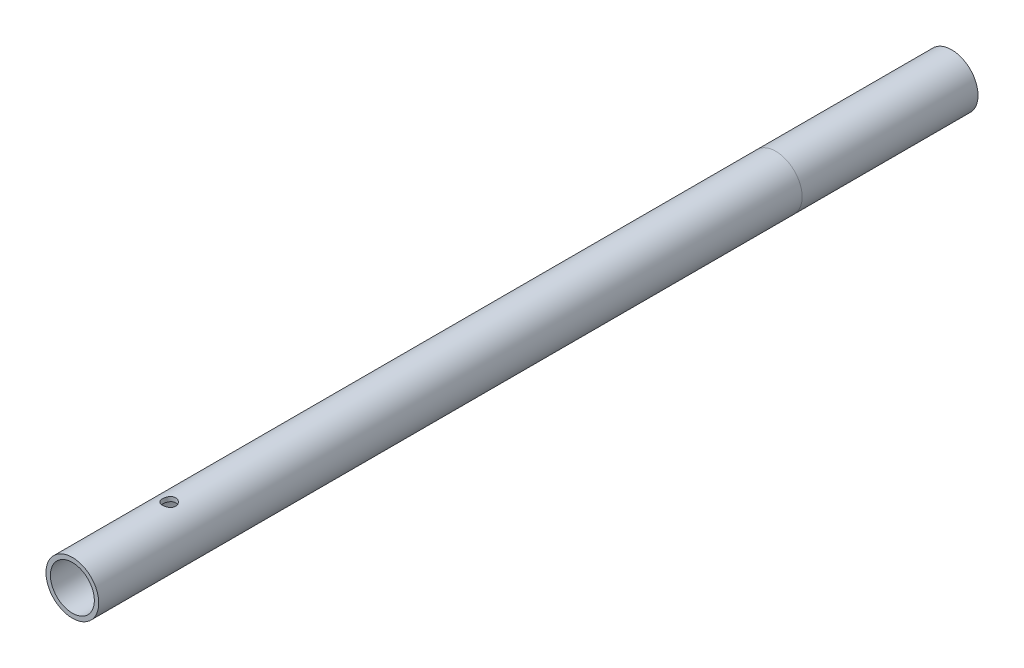
ISO-10303-21;
HEADER;
FILE_DESCRIPTION(('STEP AP214'),'2;1');
FILE_NAME('part.step','',(''),(''),'','','');
FILE_SCHEMA(('AUTOMOTIVE_DESIGN { 1 0 10303 214 1 1 1 1 }'));
ENDSEC;
DATA;
#1=APPLICATION_CONTEXT('core data for automotive mechanical design processes');
#2=APPLICATION_PROTOCOL_DEFINITION('international standard','automotive_design',2000,#1);
#3=PRODUCT_CONTEXT('',#1,'mechanical');
#4=PRODUCT('Part','Part','',(#3));
#5=PRODUCT_RELATED_PRODUCT_CATEGORY('part','',(#4));
#6=PRODUCT_DEFINITION_FORMATION('','',#4);
#7=PRODUCT_DEFINITION_CONTEXT('part definition',#1,'design');
#8=PRODUCT_DEFINITION('design','',#6,#7);
#9=PRODUCT_DEFINITION_SHAPE('','',#8);
#10=(LENGTH_UNIT() NAMED_UNIT(*) SI_UNIT(.MILLI.,.METRE.));
#11=(NAMED_UNIT(*) PLANE_ANGLE_UNIT() SI_UNIT($,.RADIAN.));
#12=(NAMED_UNIT(*) SI_UNIT($,.STERADIAN.) SOLID_ANGLE_UNIT());
#13=UNCERTAINTY_MEASURE_WITH_UNIT(LENGTH_MEASURE(1.E-05),#10,'distance_accuracy_value','');
#14=(GEOMETRIC_REPRESENTATION_CONTEXT(3) GLOBAL_UNCERTAINTY_ASSIGNED_CONTEXT((#13)) GLOBAL_UNIT_ASSIGNED_CONTEXT((#10,
#11,#12)) REPRESENTATION_CONTEXT('',''));
#15=CARTESIAN_POINT('',(0.,0.,0.));
#16=DIRECTION('',(0.,0.,1.));
#17=DIRECTION('',(1.,0.,0.));
#18=AXIS2_PLACEMENT_3D('',#15,#16,#17);
#19=CARTESIAN_POINT('',(0.,0.,200.));
#20=DIRECTION('',(0.,0.,-1.));
#21=DIRECTION('',(-1.,0.,0.));
#22=AXIS2_PLACEMENT_3D('',#19,#20,#21);
#23=CYLINDRICAL_SURFACE('',#22,6.);
#24=CARTESIAN_POINT('',(0.,-6.,179.5));
#25=CARTESIAN_POINT('',(0.0828760886697305,-5.99999859868013,179.499997674262));
#26=CARTESIAN_POINT('',(0.165778157830763,-5.99826578131828,179.493108449226));
#27=CARTESIAN_POINT('',(0.32920632377053,-5.99152113829892,179.465774848693));
#28=CARTESIAN_POINT('',(0.409731046870735,-5.98650745419968,179.445322790462));
#29=CARTESIAN_POINT('',(0.56602087218257,-5.9737562633204,179.391560746538));
#30=CARTESIAN_POINT('',(0.641791563429995,-5.96602202842087,179.358266201285));
#31=CARTESIAN_POINT('',(0.786672131904418,-5.94865343807593,179.279818609955));
#32=CARTESIAN_POINT('',(0.85578178434875,-5.93901901854051,179.234665163881));
#33=CARTESIAN_POINT('',(0.98680192730091,-5.91867413591801,179.132799210346));
#34=CARTESIAN_POINT('',(1.04855569006106,-5.90794707148533,179.075888425041));
#35=CARTESIAN_POINT('',(1.1617489272033,-5.8867362011753,178.952547795091));
#36=CARTESIAN_POINT('',(1.21318723694913,-5.87625242288349,178.886116877054));
#37=CARTESIAN_POINT('',(1.30502654279903,-5.8565477569971,178.744404773263));
#38=CARTESIAN_POINT('',(1.34525221592536,-5.84734794470605,178.66900676919));
#39=CARTESIAN_POINT('',(1.41239690855053,-5.83149494812223,178.512251588342));
#40=CARTESIAN_POINT('',(1.43931805543934,-5.82484135672789,178.430895366674));
#41=CARTESIAN_POINT('',(1.47855483680429,-5.81500476717551,178.266256501798));
#42=CARTESIAN_POINT('',(1.49115226833334,-5.81175491075426,178.18304510395));
#43=CARTESIAN_POINT('',(1.50226177506785,-5.80889362537741,178.015631430986));
#44=CARTESIAN_POINT('',(1.50077614181798,-5.80928160448644,177.931429319301));
#45=CARTESIAN_POINT('',(1.48398652463928,-5.81359205496618,177.766584192256));
#46=CARTESIAN_POINT('',(1.46901834019052,-5.81742863001879,177.685904378535));
#47=CARTESIAN_POINT('',(1.4262241869031,-5.82806709676484,177.528238949089));
#48=CARTESIAN_POINT('',(1.39839730206941,-5.83486919970697,177.451253596971));
#49=CARTESIAN_POINT('',(1.33038947793714,-5.85075113904187,177.302261983748));
#50=CARTESIAN_POINT('',(1.2900866672329,-5.85985327469421,177.23031382821));
#51=CARTESIAN_POINT('',(1.19835627601495,-5.87929710846386,177.094081290243));
#52=CARTESIAN_POINT('',(1.14692674880884,-5.88963902334735,177.029798251933));
#53=CARTESIAN_POINT('',(1.03266342468121,-5.91075880539781,176.908796384306));
#54=CARTESIAN_POINT('',(0.969546258165856,-5.92154069477971,176.852345509939));
#55=CARTESIAN_POINT('',(0.8346119175037,-5.94205965578786,176.750778757536));
#56=CARTESIAN_POINT('',(0.762794477707949,-5.95179669549415,176.705663225736));
#57=CARTESIAN_POINT('',(0.6121158886814,-5.96917732094182,176.627949413776));
#58=CARTESIAN_POINT('',(0.53323139320863,-5.97681360127725,176.595394659746));
#59=CARTESIAN_POINT('',(0.370876008142888,-5.98907916991419,176.54408269429));
#60=CARTESIAN_POINT('',(0.28740599915049,-5.99370903339281,176.525322843582));
#61=CARTESIAN_POINT('',(0.120539970390031,-5.99935499271375,176.502542434441));
#62=CARTESIAN_POINT('',(0.0371967199882132,-6.00046053508279,176.498156973925));
#63=CARTESIAN_POINT('',(-0.129032874801507,-5.99918804814451,176.503249002055));
#64=CARTESIAN_POINT('',(-0.211919259644595,-5.99681033241847,176.512725242799));
#65=CARTESIAN_POINT('',(-0.373614268776491,-5.98889581127357,176.544970908391));
#66=CARTESIAN_POINT('',(-0.452465118968753,-5.98340634185811,176.567541263477));
#67=CARTESIAN_POINT('',(-0.605257292452509,-5.96988706634134,176.625107084028));
#68=CARTESIAN_POINT('',(-0.679198119032632,-5.96185700369892,176.660103804313));
#69=CARTESIAN_POINT('',(-0.821523134429845,-5.9439330792631,176.742236128875));
#70=CARTESIAN_POINT('',(-0.889785441835828,-5.93400867366932,176.789576112397));
#71=CARTESIAN_POINT('',(-1.01752661364324,-5.91344509187419,176.894789908797));
#72=CARTESIAN_POINT('',(-1.07700395897301,-5.90280579251705,176.952665539617));
#73=CARTESIAN_POINT('',(-1.18699056807273,-5.88168956960771,177.079001960844));
#74=CARTESIAN_POINT('',(-1.23724386762203,-5.87122304187281,177.147687703002));
#75=CARTESIAN_POINT('',(-1.32551075901269,-5.85192878377239,177.292732634466));
#76=CARTESIAN_POINT('',(-1.36352489415793,-5.84310098067026,177.36909148296));
#77=CARTESIAN_POINT('',(-1.42595142060929,-5.82818094734665,177.526905722413));
#78=CARTESIAN_POINT('',(-1.45044439665406,-5.82207255291906,177.608327628344));
#79=CARTESIAN_POINT('',(-1.48534565995378,-5.81326744090184,177.774309637889));
#80=CARTESIAN_POINT('',(-1.49575702747866,-5.81056997719936,177.858869051032));
#81=CARTESIAN_POINT('',(-1.502038590334,-5.80894901203957,178.026121023855));
#82=CARTESIAN_POINT('',(-1.49831789778012,-5.80991932728264,178.108797435125));
#83=CARTESIAN_POINT('',(-1.47737727831287,-5.81527909007843,178.272303888668));
#84=CARTESIAN_POINT('',(-1.46015762268677,-5.81966846891857,178.353133968014));
#85=CARTESIAN_POINT('',(-1.41293131944279,-5.83131260682723,178.510208459065));
#86=CARTESIAN_POINT('',(-1.38300140468037,-5.8385501523631,178.58647730524));
#87=CARTESIAN_POINT('',(-1.31126491360507,-5.85507755724829,178.732965382714));
#88=CARTESIAN_POINT('',(-1.2694566900342,-5.86436770120773,178.803183773187));
#89=CARTESIAN_POINT('',(-1.17386774863715,-5.88425634263512,178.937554629002));
#90=CARTESIAN_POINT('',(-1.11980316291226,-5.89488264831757,179.001501073424));
#91=CARTESIAN_POINT('',(-1.00178937118974,-5.91608027246286,179.119547044795));
#92=CARTESIAN_POINT('',(-0.937837821261161,-5.92665157727059,179.173644230113));
#93=CARTESIAN_POINT('',(-0.800467586702604,-5.94677655647663,179.271411308565));
#94=CARTESIAN_POINT('',(-0.72689842231639,-5.95630833365868,179.314874613672));
#95=CARTESIAN_POINT('',(-0.573266059510471,-5.97304924975119,179.388747462941));
#96=CARTESIAN_POINT('',(-0.493207563436736,-5.98026005199781,179.419166360649));
#97=CARTESIAN_POINT('',(-0.344410253243468,-5.99048059565542,179.46157183033));
#98=CARTESIAN_POINT('',(-0.276380170908064,-5.99402585052691,179.475951243053));
#99=CARTESIAN_POINT('',(-0.13890607153628,-5.99878605231948,179.495165943622));
#100=CARTESIAN_POINT('',(-0.0694621612426149,-6.00000117450894,179.500001949305));
#101=CARTESIAN_POINT('',(0.,-6.,179.5));
#102=B_SPLINE_CURVE_WITH_KNOTS('',3,(#24,#25,#26,#27,#28,#29,#30,#31,#32,#33,#34,#35,#36,#37,
#38,#39,#40,#41,#42,#43,#44,#45,#46,#47,#48,#49,#50,#51,#52,#53,#54,#55,#56,#57,#58,#59,#60,#61,
#62,#63,#64,#65,#66,#67,#68,#69,#70,#71,#72,#73,#74,#75,#76,#77,#78,#79,#80,#81,#82,#83,#84,#85,
#86,#87,#88,#89,#90,#91,#92,#93,#94,#95,#96,#97,#98,#99,#100,#101),.UNSPECIFIED.,.T.,.F.,(4,2,2,
2,2,2,2,2,2,2,2,2,2,2,2,2,2,2,2,2,2,2,2,2,2,2,2,2,2,2,2,2,2,2,2,2,2,2,4),(0.,0.248373712471889,
0.496888237763897,0.745104902286081,0.993329940169324,1.24614435437139,1.49898729580059,
1.75558647545806,2.01214461169368,2.26356295099429,2.51494038112698,2.76022497007021,
3.00552703466042,3.25330527873881,3.50112690836164,3.75601500969021,4.01091089558247,
4.26668229009115,4.52240473688643,4.77158308949277,5.02073901112744,5.26620274514039,
5.51169127322291,5.76153587565353,6.0114236300802,6.26744509204477,6.5234551874951,
6.77792254614036,7.03233423252408,7.27943780398614,7.52653640956037,7.7721640055945,
8.01782568136901,8.26989576409911,8.52202569770418,8.7787218549959,9.03523363821353,
9.24342242942151,9.45159556043041),.UNSPECIFIED.);
#103=CARTESIAN_POINT('',(0.,-6.,179.5));
#104=VERTEX_POINT('',#103);
#105=EDGE_CURVE('E84',#104,#104,#102,.T.);
#106=ORIENTED_EDGE('',*,*,#105,.T.);
#107=EDGE_LOOP('',(#106));
#108=FACE_BOUND('',#107,.T.);
#109=CARTESIAN_POINT('',(0.,6.,179.5));
#110=CARTESIAN_POINT('',(-0.0828760886697304,5.99999859868012,179.499997674262));
#111=CARTESIAN_POINT('',(-0.165778157830762,5.99826578131828,179.493108449226));
#112=CARTESIAN_POINT('',(-0.329206323770531,5.99152113829892,179.465774848693));
#113=CARTESIAN_POINT('',(-0.409731046870738,5.98650745419968,179.445322790462));
#114=CARTESIAN_POINT('',(-0.56602087218257,5.9737562633204,179.391560746538));
#115=CARTESIAN_POINT('',(-0.641791563429992,5.96602202842087,179.358266201285));
#116=CARTESIAN_POINT('',(-0.786672131904414,5.94865343807593,179.279818609955));
#117=CARTESIAN_POINT('',(-0.85578178434875,5.93901901854051,179.234665163881));
#118=CARTESIAN_POINT('',(-0.986801927300914,5.91867413591801,179.132799210346));
#119=CARTESIAN_POINT('',(-1.04855569006107,5.90794707148533,179.075888425041));
#120=CARTESIAN_POINT('',(-1.1617489272033,5.8867362011753,178.952547795091));
#121=CARTESIAN_POINT('',(-1.21318723694913,5.87625242288349,178.886116877054));
#122=CARTESIAN_POINT('',(-1.30502654279903,5.8565477569971,178.744404773263));
#123=CARTESIAN_POINT('',(-1.34525221592536,5.84734794470605,178.66900676919));
#124=CARTESIAN_POINT('',(-1.41239690855053,5.83149494812223,178.512251588342));
#125=CARTESIAN_POINT('',(-1.43931805543934,5.82484135672789,178.430895366674));
#126=CARTESIAN_POINT('',(-1.47855483680429,5.81500476717551,178.266256501798));
#127=CARTESIAN_POINT('',(-1.49115226833334,5.81175491075426,178.18304510395));
#128=CARTESIAN_POINT('',(-1.50226177506785,5.80889362537741,178.015631430986));
#129=CARTESIAN_POINT('',(-1.50077614181798,5.80928160448644,177.931429319301));
#130=CARTESIAN_POINT('',(-1.48398652463928,5.81359205496618,177.766584192256));
#131=CARTESIAN_POINT('',(-1.46901834019052,5.81742863001879,177.685904378535));
#132=CARTESIAN_POINT('',(-1.4262241869031,5.82806709676484,177.528238949089));
#133=CARTESIAN_POINT('',(-1.39839730206941,5.83486919970697,177.451253596971));
#134=CARTESIAN_POINT('',(-1.33038947793714,5.85075113904187,177.302261983748));
#135=CARTESIAN_POINT('',(-1.2900866672329,5.85985327469421,177.23031382821));
#136=CARTESIAN_POINT('',(-1.19835627601495,5.87929710846386,177.094081290243));
#137=CARTESIAN_POINT('',(-1.14692674880884,5.88963902334735,177.029798251933));
#138=CARTESIAN_POINT('',(-1.03266342468121,5.91075880539781,176.908796384306));
#139=CARTESIAN_POINT('',(-0.969546258165856,5.92154069477971,176.852345509939));
#140=CARTESIAN_POINT('',(-0.8346119175037,5.94205965578786,176.750778757536));
#141=CARTESIAN_POINT('',(-0.762794477707949,5.95179669549415,176.705663225736));
#142=CARTESIAN_POINT('',(-0.6121158886814,5.96917732094182,176.627949413776));
#143=CARTESIAN_POINT('',(-0.53323139320863,5.97681360127725,176.595394659746));
#144=CARTESIAN_POINT('',(-0.370876008142887,5.98907916991419,176.54408269429));
#145=CARTESIAN_POINT('',(-0.287405999150489,5.99370903339281,176.525322843582));
#146=CARTESIAN_POINT('',(-0.120539970390031,5.99935499271375,176.502542434441));
#147=CARTESIAN_POINT('',(-0.0371967199882122,6.00046053508279,176.498156973925));
#148=CARTESIAN_POINT('',(0.129032874801508,5.99918804814451,176.503249002055));
#149=CARTESIAN_POINT('',(0.211919259644596,5.99681033241847,176.512725242799));
#150=CARTESIAN_POINT('',(0.373614268776492,5.98889581127357,176.544970908391));
#151=CARTESIAN_POINT('',(0.452465118968753,5.98340634185811,176.567541263477));
#152=CARTESIAN_POINT('',(0.60525729245251,5.96988706634134,176.625107084028));
#153=CARTESIAN_POINT('',(0.679198119032635,5.96185700369892,176.660103804313));
#154=CARTESIAN_POINT('',(0.821523134429842,5.9439330792631,176.742236128875));
#155=CARTESIAN_POINT('',(0.889785441835817,5.93400867366932,176.789576112397));
#156=CARTESIAN_POINT('',(1.01752661364323,5.9134450918742,176.894789908797));
#157=CARTESIAN_POINT('',(1.077003958973,5.90280579251705,176.952665539617));
#158=CARTESIAN_POINT('',(1.18699056807273,5.88168956960771,177.079001960844));
#159=CARTESIAN_POINT('',(1.23724386762203,5.87122304187281,177.147687703002));
#160=CARTESIAN_POINT('',(1.32551075901269,5.85192878377239,177.292732634466));
#161=CARTESIAN_POINT('',(1.36352489415793,5.84310098067026,177.36909148296));
#162=CARTESIAN_POINT('',(1.42595142060929,5.82818094734665,177.526905722413));
#163=CARTESIAN_POINT('',(1.45044439665406,5.82207255291906,177.608327628344));
#164=CARTESIAN_POINT('',(1.48534565995378,5.81326744090184,177.774309637889));
#165=CARTESIAN_POINT('',(1.49575702747866,5.81056997719936,177.858869051032));
#166=CARTESIAN_POINT('',(1.502038590334,5.80894901203957,178.026121023855));
#167=CARTESIAN_POINT('',(1.49831789778012,5.80991932728264,178.108797435125));
#168=CARTESIAN_POINT('',(1.47737727831287,5.81527909007843,178.272303888668));
#169=CARTESIAN_POINT('',(1.46015762268677,5.81966846891857,178.353133968014));
#170=CARTESIAN_POINT('',(1.41293131944279,5.83131260682723,178.510208459065));
#171=CARTESIAN_POINT('',(1.38300140468037,5.8385501523631,178.58647730524));
#172=CARTESIAN_POINT('',(1.31126491360507,5.85507755724829,178.732965382714));
#173=CARTESIAN_POINT('',(1.2694566900342,5.86436770120773,178.803183773187));
#174=CARTESIAN_POINT('',(1.17386774863715,5.88425634263512,178.937554629002));
#175=CARTESIAN_POINT('',(1.11980316291226,5.89488264831757,179.001501073424));
#176=CARTESIAN_POINT('',(1.00178937118974,5.91608027246286,179.119547044795));
#177=CARTESIAN_POINT('',(0.93783782126116,5.92665157727059,179.173644230113));
#178=CARTESIAN_POINT('',(0.800467586702607,5.94677655647663,179.271411308565));
#179=CARTESIAN_POINT('',(0.726898422316397,5.95630833365868,179.314874613672));
#180=CARTESIAN_POINT('',(0.573266059510478,5.97304924975118,179.388747462941));
#181=CARTESIAN_POINT('',(0.493207563436739,5.98026005199781,179.419166360649));
#182=CARTESIAN_POINT('',(0.344410253243467,5.99048059565542,179.46157183033));
#183=CARTESIAN_POINT('',(0.276380170908063,5.99402585052691,179.475951243053));
#184=CARTESIAN_POINT('',(0.138906071536279,5.99878605231948,179.495165943622));
#185=CARTESIAN_POINT('',(0.0694621612426144,6.00000117450894,179.500001949305));
#186=CARTESIAN_POINT('',(0.,6.,179.5));
#187=B_SPLINE_CURVE_WITH_KNOTS('',3,(#109,#110,#111,#112,#113,#114,#115,#116,#117,#118,#119,
#120,#121,#122,#123,#124,#125,#126,#127,#128,#129,#130,#131,#132,#133,#134,#135,#136,#137,#138,
#139,#140,#141,#142,#143,#144,#145,#146,#147,#148,#149,#150,#151,#152,#153,#154,#155,#156,#157,
#158,#159,#160,#161,#162,#163,#164,#165,#166,#167,#168,#169,#170,#171,#172,#173,#174,#175,#176,
#177,#178,#179,#180,#181,#182,#183,#184,#185,#186),.UNSPECIFIED.,.T.,.F.,(4,2,2,2,2,2,2,2,2,2,2,
2,2,2,2,2,2,2,2,2,2,2,2,2,2,2,2,2,2,2,2,2,2,2,2,2,2,2,4),(0.,0.248373712471889,
0.496888237763898,0.745104902286092,0.993329940169321,1.24614435437138,1.49898729580059,
1.75558647545805,2.01214461169368,2.26356295099429,2.51494038112698,2.76022497007021,
3.00552703466042,3.25330527873881,3.50112690836164,3.7560150096902,4.01091089558246,
4.26668229009114,4.52240473688643,4.77158308949277,5.02073901112744,5.26620274514038,
5.5116912732229,5.76153587565351,6.01142363008019,6.26744509204476,6.52345518749509,
6.77792254614035,7.03233423252408,7.27943780398614,7.52653640956036,7.77216400559449,
8.01782568136901,8.2698957640991,8.52202569770417,8.77872185499588,9.03523363821353,
9.24342242942151,9.45159556043041),.UNSPECIFIED.);
#188=CARTESIAN_POINT('',(0.,6.,179.5));
#189=VERTEX_POINT('',#188);
#190=EDGE_CURVE('E79',#189,#189,#187,.T.);
#191=ORIENTED_EDGE('',*,*,#190,.T.);
#192=EDGE_LOOP('',(#191));
#193=FACE_BOUND('',#192,.T.);
#194=CARTESIAN_POINT('',(0.,0.,200.));
#195=DIRECTION('',(0.,0.,1.));
#196=DIRECTION('',(1.,0.,0.));
#197=AXIS2_PLACEMENT_3D('',#194,#195,#196);
#198=CIRCLE('',#197,6.);
#199=CARTESIAN_POINT('',(6.,0.,200.));
#200=VERTEX_POINT('',#199);
#201=EDGE_CURVE('E51',#200,#200,#198,.T.);
#202=ORIENTED_EDGE('',*,*,#201,.F.);
#203=EDGE_LOOP('',(#202));
#204=FACE_BOUND('',#203,.T.);
#205=CARTESIAN_POINT('',(0.,0.,40.));
#206=DIRECTION('',(0.,0.,-1.));
#207=DIRECTION('',(-1.,0.,0.));
#208=AXIS2_PLACEMENT_3D('',#205,#206,#207);
#209=CIRCLE('',#208,6.);
#210=CARTESIAN_POINT('',(-6.,0.,40.));
#211=VERTEX_POINT('',#210);
#212=EDGE_CURVE('E10',#211,#211,#209,.T.);
#213=ORIENTED_EDGE('',*,*,#212,.F.);
#214=EDGE_LOOP('',(#213));
#215=FACE_BOUND('',#214,.T.);
#216=ADVANCED_FACE('F36',(#108,#193,#204,#215),#23,.T.);
#217=CARTESIAN_POINT('',(0.,0.,200.));
#218=DIRECTION('',(0.,0.,1.));
#219=DIRECTION('',(1.,0.,0.));
#220=AXIS2_PLACEMENT_3D('',#217,#218,#219);
#221=PLANE('',#220);
#222=ORIENTED_EDGE('',*,*,#201,.T.);
#223=EDGE_LOOP('',(#222));
#224=FACE_BOUND('',#223,.T.);
#225=CARTESIAN_POINT('',(0.,0.,200.));
#226=DIRECTION('',(0.,0.,1.));
#227=DIRECTION('',(1.,0.,0.));
#228=AXIS2_PLACEMENT_3D('',#225,#226,#227);
#229=CIRCLE('',#228,5.);
#230=CARTESIAN_POINT('',(5.,0.,200.));
#231=VERTEX_POINT('',#230);
#232=EDGE_CURVE('E91',#231,#231,#229,.T.);
#233=ORIENTED_EDGE('',*,*,#232,.F.);
#234=EDGE_LOOP('',(#233));
#235=FACE_BOUND('',#234,.T.);
#236=ADVANCED_FACE('F109',(#224,#235),#221,.T.);
#237=CARTESIAN_POINT('',(0.,0.,0.));
#238=DIRECTION('',(0.,0.,1.));
#239=DIRECTION('',(1.,0.,0.));
#240=AXIS2_PLACEMENT_3D('',#237,#238,#239);
#241=PLANE('',#240);
#242=CARTESIAN_POINT('',(0.,0.,0.));
#243=DIRECTION('',(0.,0.,1.));
#244=DIRECTION('',(1.,0.,0.));
#245=AXIS2_PLACEMENT_3D('',#242,#243,#244);
#246=CIRCLE('',#245,6.);
#247=CARTESIAN_POINT('',(6.,0.,0.));
#248=VERTEX_POINT('',#247);
#249=EDGE_CURVE('E58',#248,#248,#246,.T.);
#250=ORIENTED_EDGE('',*,*,#249,.F.);
#251=EDGE_LOOP('',(#250));
#252=FACE_BOUND('',#251,.T.);
#253=CARTESIAN_POINT('',(0.,0.,0.));
#254=DIRECTION('',(0.,0.,1.));
#255=DIRECTION('',(1.,0.,0.));
#256=AXIS2_PLACEMENT_3D('',#253,#254,#255);
#257=CIRCLE('',#256,5.);
#258=CARTESIAN_POINT('',(5.,0.,0.));
#259=VERTEX_POINT('',#258);
#260=EDGE_CURVE('E90',#259,#259,#257,.T.);
#261=ORIENTED_EDGE('',*,*,#260,.T.);
#262=EDGE_LOOP('',(#261));
#263=FACE_BOUND('',#262,.T.);
#264=ADVANCED_FACE('F97',(#252,#263),#241,.F.);
#265=ORIENTED_EDGE('',*,*,#212,.T.);
#266=EDGE_LOOP('',(#265));
#267=FACE_BOUND('',#266,.T.);
#268=ORIENTED_EDGE('',*,*,#249,.T.);
#269=EDGE_LOOP('',(#268));
#270=FACE_BOUND('',#269,.T.);
#271=ADVANCED_FACE('F38',(#267,#270),#23,.T.);
#272=CARTESIAN_POINT('',(0.,0.,200.));
#273=DIRECTION('',(0.,0.,-1.));
#274=DIRECTION('',(-1.,0.,0.));
#275=AXIS2_PLACEMENT_3D('',#272,#273,#274);
#276=CYLINDRICAL_SURFACE('',#275,5.);
#277=CARTESIAN_POINT('',(0.,-5.,179.5));
#278=CARTESIAN_POINT('',(0.0822886127532983,-4.9999992925055,179.499999002515));
#279=CARTESIAN_POINT('',(0.164587318351527,-4.99794915693954,179.493206136376));
#280=CARTESIAN_POINT('',(0.326788125304878,-4.98997105593691,179.466278645778));
#281=CARTESIAN_POINT('',(0.406689504411416,-4.98404193389692,179.446140041977));
#282=CARTESIAN_POINT('',(0.561732707754526,-4.96895552501836,179.39325398309));
#283=CARTESIAN_POINT('',(0.636881364395376,-4.95980300250425,179.360525130381));
#284=CARTESIAN_POINT('',(0.780624181053137,-4.93922109237645,179.283463906944));
#285=CARTESIAN_POINT('',(0.849217467469674,-4.92779140192067,179.239129992605));
#286=CARTESIAN_POINT('',(0.979871797183739,-4.90350737192774,179.138775992527));
#287=CARTESIAN_POINT('',(1.04171807124432,-4.89062383657037,179.082483374114));
#288=CARTESIAN_POINT('',(1.15524920923322,-4.86505834210443,178.96039077009));
#289=CARTESIAN_POINT('',(1.2069323632744,-4.85237641724502,178.894589187875));
#290=CARTESIAN_POINT('',(1.29980037723708,-4.82834113993772,178.753529246962));
#291=CARTESIAN_POINT('',(1.34072309022213,-4.81702406663875,178.678091539009));
#292=CARTESIAN_POINT('',(1.4092139477476,-4.79743620394031,178.52101074577));
#293=CARTESIAN_POINT('',(1.43678529919973,-4.78916468313311,178.439369156072));
#294=CARTESIAN_POINT('',(1.47701633682651,-4.77690870838434,178.27460973387));
#295=CARTESIAN_POINT('',(1.49007196234677,-4.77281069324533,178.191597256136));
#296=CARTESIAN_POINT('',(1.50213730614672,-4.76902789749767,178.024466843783));
#297=CARTESIAN_POINT('',(1.50115042761079,-4.76934204760571,177.940349181941));
#298=CARTESIAN_POINT('',(1.48546977199812,-4.77424744067778,177.776616091392));
#299=CARTESIAN_POINT('',(1.47127205262686,-4.7786838859914,177.696947749638));
#300=CARTESIAN_POINT('',(1.43037420427057,-4.79108356228624,177.541180213727));
#301=CARTESIAN_POINT('',(1.40367284141642,-4.7990471413235,177.465081372626));
#302=CARTESIAN_POINT('',(1.33816026653683,-4.81772733074973,177.317399650339));
#303=CARTESIAN_POINT('',(1.29918816934644,-4.82848016115952,177.245892916045));
#304=CARTESIAN_POINT('',(1.21035222588685,-4.85150987000064,177.11026797799));
#305=CARTESIAN_POINT('',(1.1604857400259,-4.86378711746991,177.046151570586));
#306=CARTESIAN_POINT('',(1.04881290765548,-4.88911011297937,176.924313809238));
#307=CARTESIAN_POINT('',(0.986594907466982,-4.90216654310498,176.86697133597));
#308=CARTESIAN_POINT('',(0.853263259313972,-4.92712244063258,176.763446015936));
#309=CARTESIAN_POINT('',(0.782149051860892,-4.9390218351841,176.717263871586));
#310=CARTESIAN_POINT('',(0.632355038342807,-4.9604316006947,176.637140077535));
#311=CARTESIAN_POINT('',(0.553627749747957,-4.96992543668314,176.60328248375));
#312=CARTESIAN_POINT('',(0.391245415603525,-4.98533521832222,176.5494004099));
#313=CARTESIAN_POINT('',(0.307591751589586,-4.99125216186999,176.529372071468));
#314=CARTESIAN_POINT('',(0.140952242668335,-4.99868364643538,176.504347822101));
#315=CARTESIAN_POINT('',(0.058050097601191,-5.0003485041779,176.498838414198));
#316=CARTESIAN_POINT('',(-0.107499605823378,-4.9995292324176,176.501569155712));
#317=CARTESIAN_POINT('',(-0.190147196690776,-4.99704565677756,176.509807469651));
#318=CARTESIAN_POINT('',(-0.350903605309691,-4.98830696987163,176.539384611112));
#319=CARTESIAN_POINT('',(-0.429072772614163,-4.98213829799417,176.560423387581));
#320=CARTESIAN_POINT('',(-0.580754638954516,-4.96674347841533,176.614643232778));
#321=CARTESIAN_POINT('',(-0.654266777025579,-4.95751696321085,176.647825761038));
#322=CARTESIAN_POINT('',(-0.796437189461054,-4.93669654351325,176.726253165481));
#323=CARTESIAN_POINT('',(-0.864943826199676,-4.92505280829675,176.771759340948));
#324=CARTESIAN_POINT('',(-0.993523307980154,-4.90073468764317,176.873224754053));
#325=CARTESIAN_POINT('',(-1.05359403235594,-4.8880600443108,176.929186611888));
#326=CARTESIAN_POINT('',(-1.16585744551027,-4.86253171869138,177.052387308369));
#327=CARTESIAN_POINT('',(-1.21768481231504,-4.84968825033268,177.119961875772));
#328=CARTESIAN_POINT('',(-1.30928995072154,-4.82576515238463,177.263127939014));
#329=CARTESIAN_POINT('',(-1.34906803829472,-4.81468547654651,177.338719224558));
#330=CARTESIAN_POINT('',(-1.41517347127168,-4.79567189615055,177.495532491255));
#331=CARTESIAN_POINT('',(-1.44156346937049,-4.78772337843827,177.576726186537));
#332=CARTESIAN_POINT('',(-1.48021730815114,-4.77591594362794,177.742687968931));
#333=CARTESIAN_POINT('',(-1.49248598978779,-4.772055625083,177.827454820788));
#334=CARTESIAN_POINT('',(-1.50221984485059,-4.76899972496087,177.994361518376));
#335=CARTESIAN_POINT('',(-1.5002805530849,-4.76961647442754,178.076463651018));
#336=CARTESIAN_POINT('',(-1.48307505444814,-4.77499401288294,178.239114103373));
#337=CARTESIAN_POINT('',(-1.46780938124716,-4.77975463592551,178.319662485176));
#338=CARTESIAN_POINT('',(-1.42476888804136,-4.79275763670386,178.475945399143));
#339=CARTESIAN_POINT('',(-1.39715175507068,-4.80095604545965,178.551727287362));
#340=CARTESIAN_POINT('',(-1.33031507121128,-4.81990278909136,178.697642438818));
#341=CARTESIAN_POINT('',(-1.29109329962875,-4.83065161194312,178.767774617641));
#342=CARTESIAN_POINT('',(-1.20048763805071,-4.85397676425833,178.903163116527));
#343=CARTESIAN_POINT('',(-1.14871276092993,-4.86660540163798,178.96814876126));
#344=CARTESIAN_POINT('',(-1.03517434629781,-4.89201320450026,179.088702498308));
#345=CARTESIAN_POINT('',(-0.973408217134499,-4.90479240823905,179.144268139468));
#346=CARTESIAN_POINT('',(-0.83946576218325,-4.92950936570649,179.246023412295));
#347=CARTESIAN_POINT('',(-0.767037885790611,-4.94141159765674,179.291891446856));
#348=CARTESIAN_POINT('',(-0.615141373983534,-4.96260680455813,179.370735169904));
#349=CARTESIAN_POINT('',(-0.535676052998959,-4.97190099931066,179.403716888275));
#350=CARTESIAN_POINT('',(-0.380757712655282,-4.98602174969301,179.452895275653));
#351=CARTESIAN_POINT('',(-0.305786961954234,-4.99122027381068,179.470511672883));
#352=CARTESIAN_POINT('',(-0.153880195230779,-4.99820944494492,179.494063525242));
#353=CARTESIAN_POINT('',(-0.0769445098581398,-5.0000006615474,179.500000932705));
#354=CARTESIAN_POINT('',(0.,-5.,179.5));
#355=B_SPLINE_CURVE_WITH_KNOTS('',3,(#277,#278,#279,#280,#281,#282,#283,#284,#285,#286,#287,
#288,#289,#290,#291,#292,#293,#294,#295,#296,#297,#298,#299,#300,#301,#302,#303,#304,#305,#306,
#307,#308,#309,#310,#311,#312,#313,#314,#315,#316,#317,#318,#319,#320,#321,#322,#323,#324,#325,
#326,#327,#328,#329,#330,#331,#332,#333,#334,#335,#336,#337,#338,#339,#340,#341,#342,#343,#344,
#345,#346,#347,#348,#349,#350,#351,#352,#353,#354),.UNSPECIFIED.,.T.,.F.,(4,2,2,2,2,2,2,2,2,2,2,
2,2,2,2,2,2,2,2,2,2,2,2,2,2,2,2,2,2,2,2,2,2,2,2,2,2,2,4),(0.,0.246583203612607,
0.493239964845998,0.739533676300879,0.985860164412692,1.23855602948189,1.49129437288632,
1.74971481004107,2.00807314543225,2.25919689356596,2.51025978319089,2.75226016697672,
2.99428443657998,3.23962426447116,3.48502360158553,3.74067104048166,3.9963345653107,
4.25371046881688,4.51101453528807,4.75908809438545,5.00712853550326,5.24956746682327,
5.49203554593728,5.74011305702909,5.98825282000192,6.24540400322818,6.50254844252681,
6.75847814951249,7.01432009460283,7.25950155466943,7.50467319661602,7.74680040402722,
7.98897397553109,8.23996925679932,8.49102974897502,8.74942996156669,9.00770911595235,
9.23831691930459,9.46888616948874),.UNSPECIFIED.);
#356=CARTESIAN_POINT('',(0.,-5.,179.5));
#357=VERTEX_POINT('',#356);
#358=EDGE_CURVE('E41',#357,#357,#355,.T.);
#359=ORIENTED_EDGE('',*,*,#358,.F.);
#360=EDGE_LOOP('',(#359));
#361=FACE_BOUND('',#360,.T.);
#362=CARTESIAN_POINT('',(0.,5.,179.5));
#363=CARTESIAN_POINT('',(-0.0822886127532983,4.9999992925055,179.499999002515));
#364=CARTESIAN_POINT('',(-0.164587318351527,4.99794915693954,179.493206136376));
#365=CARTESIAN_POINT('',(-0.326788125304878,4.98997105593691,179.466278645778));
#366=CARTESIAN_POINT('',(-0.406689504411417,4.98404193389692,179.446140041977));
#367=CARTESIAN_POINT('',(-0.561732707754522,4.96895552501836,179.39325398309));
#368=CARTESIAN_POINT('',(-0.636881364395367,4.95980300250426,179.360525130381));
#369=CARTESIAN_POINT('',(-0.780624181053129,4.93922109237645,179.283463906944));
#370=CARTESIAN_POINT('',(-0.849217467469671,4.92779140192067,179.239129992605));
#371=CARTESIAN_POINT('',(-0.97987179718374,4.90350737192774,179.138775992527));
#372=CARTESIAN_POINT('',(-1.04171807124432,4.89062383657037,179.082483374114));
#373=CARTESIAN_POINT('',(-1.15524920923322,4.86505834210443,178.96039077009));
#374=CARTESIAN_POINT('',(-1.2069323632744,4.85237641724502,178.894589187875));
#375=CARTESIAN_POINT('',(-1.29980037723708,4.82834113993772,178.753529246962));
#376=CARTESIAN_POINT('',(-1.34072309022213,4.81702406663875,178.678091539009));
#377=CARTESIAN_POINT('',(-1.4092139477476,4.79743620394031,178.52101074577));
#378=CARTESIAN_POINT('',(-1.43678529919973,4.78916468313311,178.439369156072));
#379=CARTESIAN_POINT('',(-1.47701633682651,4.77690870838434,178.27460973387));
#380=CARTESIAN_POINT('',(-1.49007196234677,4.77281069324533,178.191597256136));
#381=CARTESIAN_POINT('',(-1.50213730614672,4.76902789749767,178.024466843783));
#382=CARTESIAN_POINT('',(-1.50115042761079,4.76934204760571,177.940349181941));
#383=CARTESIAN_POINT('',(-1.48546977199812,4.77424744067778,177.776616091392));
#384=CARTESIAN_POINT('',(-1.47127205262686,4.7786838859914,177.696947749638));
#385=CARTESIAN_POINT('',(-1.43037420427057,4.79108356228624,177.541180213727));
#386=CARTESIAN_POINT('',(-1.40367284141642,4.7990471413235,177.465081372626));
#387=CARTESIAN_POINT('',(-1.33816026653683,4.81772733074973,177.317399650339));
#388=CARTESIAN_POINT('',(-1.29918816934644,4.82848016115952,177.245892916045));
#389=CARTESIAN_POINT('',(-1.21035222588685,4.85150987000064,177.11026797799));
#390=CARTESIAN_POINT('',(-1.1604857400259,4.86378711746991,177.046151570586));
#391=CARTESIAN_POINT('',(-1.04881290765548,4.88911011297937,176.924313809238));
#392=CARTESIAN_POINT('',(-0.986594907466982,4.90216654310498,176.86697133597));
#393=CARTESIAN_POINT('',(-0.853263259313972,4.92712244063258,176.763446015936));
#394=CARTESIAN_POINT('',(-0.782149051860891,4.9390218351841,176.717263871586));
#395=CARTESIAN_POINT('',(-0.63235503834281,4.9604316006947,176.637140077535));
#396=CARTESIAN_POINT('',(-0.553627749747963,4.96992543668314,176.60328248375));
#397=CARTESIAN_POINT('',(-0.391245415603532,4.98533521832222,176.5494004099));
#398=CARTESIAN_POINT('',(-0.307591751589589,4.99125216186999,176.529372071468));
#399=CARTESIAN_POINT('',(-0.140952242668335,4.99868364643538,176.504347822101));
#400=CARTESIAN_POINT('',(-0.0580500976011913,5.0003485041779,176.498838414198));
#401=CARTESIAN_POINT('',(0.107499605823377,4.9995292324176,176.501569155712));
#402=CARTESIAN_POINT('',(0.190147196690775,4.99704565677756,176.509807469651));
#403=CARTESIAN_POINT('',(0.350903605309694,4.98830696987163,176.539384611112));
#404=CARTESIAN_POINT('',(0.42907277261417,4.98213829799417,176.560423387581));
#405=CARTESIAN_POINT('',(0.580754638954523,4.96674347841533,176.614643232778));
#406=CARTESIAN_POINT('',(0.654266777025582,4.95751696321085,176.647825761038));
#407=CARTESIAN_POINT('',(0.796437189461054,4.93669654351325,176.726253165481));
#408=CARTESIAN_POINT('',(0.864943826199676,4.92505280829675,176.771759340948));
#409=CARTESIAN_POINT('',(0.993523307980154,4.90073468764317,176.873224754053));
#410=CARTESIAN_POINT('',(1.05359403235594,4.8880600443108,176.929186611888));
#411=CARTESIAN_POINT('',(1.16585744551027,4.86253171869138,177.052387308369));
#412=CARTESIAN_POINT('',(1.21768481231504,4.84968825033268,177.119961875772));
#413=CARTESIAN_POINT('',(1.30928995072154,4.82576515238463,177.263127939014));
#414=CARTESIAN_POINT('',(1.34906803829472,4.81468547654651,177.338719224558));
#415=CARTESIAN_POINT('',(1.41517347127168,4.79567189615055,177.495532491255));
#416=CARTESIAN_POINT('',(1.44156346937049,4.78772337843827,177.576726186537));
#417=CARTESIAN_POINT('',(1.48021730815114,4.77591594362794,177.742687968931));
#418=CARTESIAN_POINT('',(1.49248598978779,4.772055625083,177.827454820788));
#419=CARTESIAN_POINT('',(1.50221984485059,4.76899972496087,177.994361518376));
#420=CARTESIAN_POINT('',(1.5002805530849,4.76961647442754,178.076463651018));
#421=CARTESIAN_POINT('',(1.48307505444814,4.77499401288294,178.239114103373));
#422=CARTESIAN_POINT('',(1.46780938124716,4.77975463592551,178.319662485176));
#423=CARTESIAN_POINT('',(1.42476888804136,4.79275763670386,178.475945399143));
#424=CARTESIAN_POINT('',(1.39715175507068,4.80095604545965,178.551727287362));
#425=CARTESIAN_POINT('',(1.33031507121128,4.81990278909136,178.697642438818));
#426=CARTESIAN_POINT('',(1.29109329962875,4.83065161194312,178.767774617641));
#427=CARTESIAN_POINT('',(1.20048763805071,4.85397676425833,178.903163116527));
#428=CARTESIAN_POINT('',(1.14871276092993,4.86660540163798,178.96814876126));
#429=CARTESIAN_POINT('',(1.03517434629781,4.89201320450026,179.088702498308));
#430=CARTESIAN_POINT('',(0.973408217134499,4.90479240823905,179.144268139468));
#431=CARTESIAN_POINT('',(0.83946576218325,4.92950936570649,179.246023412295));
#432=CARTESIAN_POINT('',(0.767037885790611,4.94141159765674,179.291891446856));
#433=CARTESIAN_POINT('',(0.615141373983534,4.96260680455813,179.370735169904));
#434=CARTESIAN_POINT('',(0.535676052998959,4.97190099931066,179.403716888275));
#435=CARTESIAN_POINT('',(0.380757712655282,4.98602174969301,179.452895275653));
#436=CARTESIAN_POINT('',(0.305786961954234,4.99122027381068,179.470511672883));
#437=CARTESIAN_POINT('',(0.153880195230779,4.99820944494492,179.494063525242));
#438=CARTESIAN_POINT('',(0.0769445098581397,5.0000006615474,179.500000932705));
#439=CARTESIAN_POINT('',(0.,5.,179.5));
#440=B_SPLINE_CURVE_WITH_KNOTS('',3,(#362,#363,#364,#365,#366,#367,#368,#369,#370,#371,#372,
#373,#374,#375,#376,#377,#378,#379,#380,#381,#382,#383,#384,#385,#386,#387,#388,#389,#390,#391,
#392,#393,#394,#395,#396,#397,#398,#399,#400,#401,#402,#403,#404,#405,#406,#407,#408,#409,#410,
#411,#412,#413,#414,#415,#416,#417,#418,#419,#420,#421,#422,#423,#424,#425,#426,#427,#428,#429,
#430,#431,#432,#433,#434,#435,#436,#437,#438,#439),.UNSPECIFIED.,.T.,.F.,(4,2,2,2,2,2,2,2,2,2,2,
2,2,2,2,2,2,2,2,2,2,2,2,2,2,2,2,2,2,2,2,2,2,2,2,2,2,2,4),(0.,0.246583203612607,
0.493239964845998,0.739533676300868,0.985860164412691,1.23855602948189,1.49129437288632,
1.74971481004107,2.00807314543225,2.25919689356596,2.51025978319089,2.75226016697672,
2.99428443657998,3.23962426447116,3.48502360158553,3.74067104048166,3.9963345653107,
4.25371046881687,4.51101453528807,4.75908809438544,5.00712853550326,5.24956746682327,
5.49203554593728,5.74011305702909,5.98825282000192,6.24540400322818,6.50254844252681,
6.75847814951249,7.01432009460283,7.25950155466943,7.50467319661602,7.74680040402722,
7.98897397553109,8.23996925679932,8.49102974897502,8.74942996156669,9.00770911595235,
9.23831691930459,9.46888616948874),.UNSPECIFIED.);
#441=CARTESIAN_POINT('',(0.,5.,179.5));
#442=VERTEX_POINT('',#441);
#443=EDGE_CURVE('E61',#442,#442,#440,.T.);
#444=ORIENTED_EDGE('',*,*,#443,.F.);
#445=EDGE_LOOP('',(#444));
#446=FACE_BOUND('',#445,.T.);
#447=ORIENTED_EDGE('',*,*,#232,.T.);
#448=EDGE_LOOP('',(#447));
#449=FACE_BOUND('',#448,.T.);
#450=ORIENTED_EDGE('',*,*,#260,.F.);
#451=EDGE_LOOP('',(#450));
#452=FACE_BOUND('',#451,.T.);
#453=ADVANCED_FACE('F66',(#361,#446,#449,#452),#276,.F.);
#454=CARTESIAN_POINT('',(0.,-6.,178.));
#455=DIRECTION('',(0.,1.,0.));
#456=DIRECTION('',(0.,0.,1.));
#457=AXIS2_PLACEMENT_3D('',#454,#455,#456);
#458=CYLINDRICAL_SURFACE('',#457,1.5);
#459=ORIENTED_EDGE('',*,*,#443,.T.);
#460=EDGE_LOOP('',(#459));
#461=FACE_BOUND('',#460,.T.);
#462=ORIENTED_EDGE('',*,*,#190,.F.);
#463=EDGE_LOOP('',(#462));
#464=FACE_BOUND('',#463,.T.);
#465=ADVANCED_FACE('F72',(#461,#464),#458,.F.);
#466=ORIENTED_EDGE('',*,*,#358,.T.);
#467=EDGE_LOOP('',(#466));
#468=FACE_BOUND('',#467,.T.);
#469=ORIENTED_EDGE('',*,*,#105,.F.);
#470=EDGE_LOOP('',(#469));
#471=FACE_BOUND('',#470,.T.);
#472=ADVANCED_FACE('F69',(#468,#471),#458,.F.);
#473=CLOSED_SHELL('',(#216,#236,#264,#271,#453,#465,#472));
#474=MANIFOLD_SOLID_BREP('B2',#473);
#475=ADVANCED_BREP_SHAPE_REPRESENTATION('',(#18,#474),#14);
#476=SHAPE_DEFINITION_REPRESENTATION(#9,#475);
ENDSEC;
END-ISO-10303-21;
